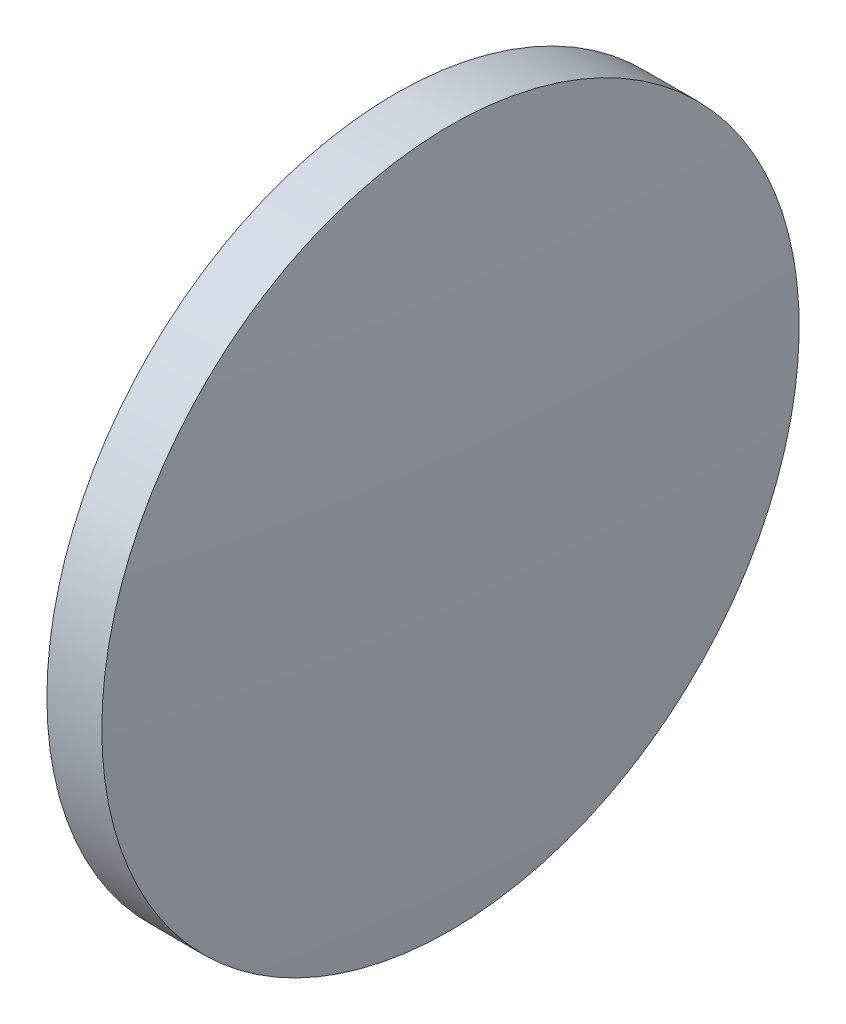
ISO-10303-21;
HEADER;
FILE_DESCRIPTION(('STEP AP214'),'2;1');
FILE_NAME('part.step','',(''),(''),'','','');
FILE_SCHEMA(('AUTOMOTIVE_DESIGN { 1 0 10303 214 1 1 1 1 }'));
ENDSEC;
DATA;
#1=APPLICATION_CONTEXT('core data for automotive mechanical design processes');
#2=APPLICATION_PROTOCOL_DEFINITION('international standard','automotive_design',2000,#1);
#3=PRODUCT_CONTEXT('',#1,'mechanical');
#4=PRODUCT('Part','Part','',(#3));
#5=PRODUCT_RELATED_PRODUCT_CATEGORY('part','',(#4));
#6=PRODUCT_DEFINITION_FORMATION('','',#4);
#7=PRODUCT_DEFINITION_CONTEXT('part definition',#1,'design');
#8=PRODUCT_DEFINITION('design','',#6,#7);
#9=PRODUCT_DEFINITION_SHAPE('','',#8);
#10=(LENGTH_UNIT() NAMED_UNIT(*) SI_UNIT(.MILLI.,.METRE.));
#11=(NAMED_UNIT(*) PLANE_ANGLE_UNIT() SI_UNIT($,.RADIAN.));
#12=(NAMED_UNIT(*) SI_UNIT($,.STERADIAN.) SOLID_ANGLE_UNIT());
#13=UNCERTAINTY_MEASURE_WITH_UNIT(LENGTH_MEASURE(1.E-05),#10,'distance_accuracy_value','');
#14=(GEOMETRIC_REPRESENTATION_CONTEXT(3) GLOBAL_UNCERTAINTY_ASSIGNED_CONTEXT((#13)) GLOBAL_UNIT_ASSIGNED_CONTEXT((#10,
#11,#12)) REPRESENTATION_CONTEXT('',''));
#15=CARTESIAN_POINT('',(0.,0.,0.));
#16=DIRECTION('',(0.,0.,1.));
#17=DIRECTION('',(1.,0.,0.));
#18=AXIS2_PLACEMENT_3D('',#15,#16,#17);
#19=CARTESIAN_POINT('',(264.322813485725,48.6161130231847,0.));
#20=DIRECTION('',(-1.,0.,0.));
#21=DIRECTION('',(0.,1.,0.));
#22=AXIS2_PLACEMENT_3D('',#19,#20,#21);
#23=SPHERICAL_SURFACE('',#22,179.314596853919);
#24=CARTESIAN_POINT('',(85.4585223460911,48.6161130231848,0.));
#25=DIRECTION('',(-1.,0.,0.));
#26=DIRECTION('',(0.,0.,1.));
#27=AXIS2_PLACEMENT_3D('',#24,#25,#26);
#28=CIRCLE('',#27,12.7);
#29=CARTESIAN_POINT('',(85.4585223460911,48.6161130231848,12.7));
#30=VERTEX_POINT('',#29);
#31=EDGE_CURVE('E41',#30,#30,#28,.T.);
#32=ORIENTED_EDGE('',*,*,#31,.T.);
#33=EDGE_LOOP('',(#32));
#34=FACE_BOUND('',#33,.T.);
#35=ADVANCED_FACE('F35',(#34),#23,.T.);
#36=CARTESIAN_POINT('',(-91.4064259363938,48.6161130231849,0.));
#37=DIRECTION('',(-1.,0.,0.));
#38=DIRECTION('',(0.,-1.,0.));
#39=AXIS2_PLACEMENT_3D('',#36,#37,#38);
#40=SPHERICAL_SURFACE('',#39,179.314596853913);
#41=CARTESIAN_POINT('',(87.457865203234,48.6161130231848,0.));
#42=DIRECTION('',(-1.,0.,0.));
#43=DIRECTION('',(0.,0.,1.));
#44=AXIS2_PLACEMENT_3D('',#41,#42,#43);
#45=CIRCLE('',#44,12.7);
#46=CARTESIAN_POINT('',(87.457865203234,48.6161130231848,12.7));
#47=VERTEX_POINT('',#46);
#48=EDGE_CURVE('E10',#47,#47,#45,.T.);
#49=ORIENTED_EDGE('',*,*,#48,.F.);
#50=EDGE_LOOP('',(#49));
#51=FACE_BOUND('',#50,.T.);
#52=ADVANCED_FACE('F50',(#51),#40,.T.);
#53=CARTESIAN_POINT('',(79.3054013508372,48.6161130231848,0.));
#54=DIRECTION('',(-1.,0.,0.));
#55=DIRECTION('',(0.,0.,1.));
#56=AXIS2_PLACEMENT_3D('',#53,#54,#55);
#57=CYLINDRICAL_SURFACE('',#56,12.7);
#58=ORIENTED_EDGE('',*,*,#48,.T.);
#59=EDGE_LOOP('',(#58));
#60=FACE_BOUND('',#59,.T.);
#61=ORIENTED_EDGE('',*,*,#31,.F.);
#62=EDGE_LOOP('',(#61));
#63=FACE_BOUND('',#62,.T.);
#64=ADVANCED_FACE('F48',(#60,#63),#57,.T.);
#65=CLOSED_SHELL('',(#35,#52,#64));
#66=MANIFOLD_SOLID_BREP('B2',#65);
#67=ADVANCED_BREP_SHAPE_REPRESENTATION('',(#18,#66),#14);
#68=SHAPE_DEFINITION_REPRESENTATION(#9,#67);
ENDSEC;
END-ISO-10303-21;
